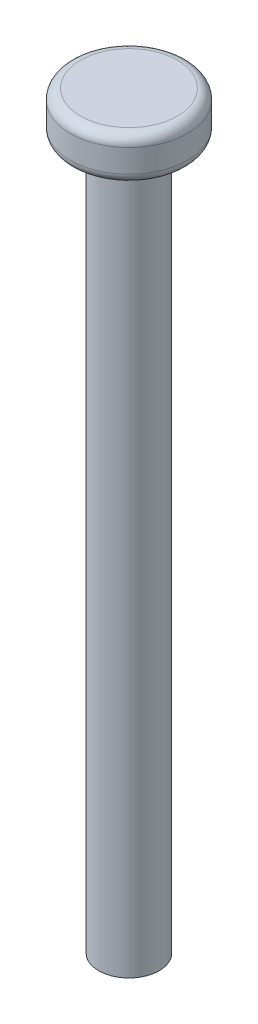
ISO-10303-21;
HEADER;
FILE_DESCRIPTION(('STEP AP214'),'2;1');
FILE_NAME('part.step','',(''),(''),'','','');
FILE_SCHEMA(('AUTOMOTIVE_DESIGN { 1 0 10303 214 1 1 1 1 }'));
ENDSEC;
DATA;
#1=APPLICATION_CONTEXT('core data for automotive mechanical design processes');
#2=APPLICATION_PROTOCOL_DEFINITION('international standard','automotive_design',2000,#1);
#3=PRODUCT_CONTEXT('',#1,'mechanical');
#4=PRODUCT('Part','Part','',(#3));
#5=PRODUCT_RELATED_PRODUCT_CATEGORY('part','',(#4));
#6=PRODUCT_DEFINITION_FORMATION('','',#4);
#7=PRODUCT_DEFINITION_CONTEXT('part definition',#1,'design');
#8=PRODUCT_DEFINITION('design','',#6,#7);
#9=PRODUCT_DEFINITION_SHAPE('','',#8);
#10=(LENGTH_UNIT() NAMED_UNIT(*) SI_UNIT(.MILLI.,.METRE.));
#11=(NAMED_UNIT(*) PLANE_ANGLE_UNIT() SI_UNIT($,.RADIAN.));
#12=(NAMED_UNIT(*) SI_UNIT($,.STERADIAN.) SOLID_ANGLE_UNIT());
#13=UNCERTAINTY_MEASURE_WITH_UNIT(LENGTH_MEASURE(1.E-05),#10,'distance_accuracy_value','');
#14=(GEOMETRIC_REPRESENTATION_CONTEXT(3) GLOBAL_UNCERTAINTY_ASSIGNED_CONTEXT((#13)) GLOBAL_UNIT_ASSIGNED_CONTEXT((#10,
#11,#12)) REPRESENTATION_CONTEXT('',''));
#15=CARTESIAN_POINT('',(0.,0.,0.));
#16=DIRECTION('',(0.,0.,1.));
#17=DIRECTION('',(1.,0.,0.));
#18=AXIS2_PLACEMENT_3D('',#15,#16,#17);
#19=CARTESIAN_POINT('',(0.,70.,0.));
#20=DIRECTION('',(0.,-1.,0.));
#21=DIRECTION('',(0.,0.,-1.));
#22=AXIS2_PLACEMENT_3D('',#19,#20,#21);
#23=CYLINDRICAL_SURFACE('',#22,3.);
#24=CARTESIAN_POINT('',(0.,70.,0.));
#25=DIRECTION('',(0.,1.,0.));
#26=DIRECTION('',(0.,0.,1.));
#27=AXIS2_PLACEMENT_3D('',#24,#25,#26);
#28=CIRCLE('',#27,3.);
#29=CARTESIAN_POINT('',(0.,70.,3.));
#30=VERTEX_POINT('',#29);
#31=EDGE_CURVE('E53',#30,#30,#28,.T.);
#32=ORIENTED_EDGE('',*,*,#31,.F.);
#33=EDGE_LOOP('',(#32));
#34=FACE_BOUND('',#33,.T.);
#35=CARTESIAN_POINT('',(0.,0.,0.));
#36=DIRECTION('',(0.,1.,0.));
#37=DIRECTION('',(0.,0.,1.));
#38=AXIS2_PLACEMENT_3D('',#35,#36,#37);
#39=CIRCLE('',#38,3.);
#40=CARTESIAN_POINT('',(0.,0.,3.));
#41=VERTEX_POINT('',#40);
#42=EDGE_CURVE('E54',#41,#41,#39,.T.);
#43=ORIENTED_EDGE('',*,*,#42,.T.);
#44=EDGE_LOOP('',(#43));
#45=FACE_BOUND('',#44,.T.);
#46=ADVANCED_FACE('F33',(#34,#45),#23,.T.);
#47=CARTESIAN_POINT('',(0.,0.,0.));
#48=DIRECTION('',(0.,1.,0.));
#49=DIRECTION('',(0.,0.,1.));
#50=AXIS2_PLACEMENT_3D('',#47,#48,#49);
#51=PLANE('',#50);
#52=ORIENTED_EDGE('',*,*,#42,.F.);
#53=EDGE_LOOP('',(#52));
#54=FACE_BOUND('',#53,.T.);
#55=ADVANCED_FACE('F64',(#54),#51,.F.);
#56=CARTESIAN_POINT('',(0.,74.3,0.));
#57=DIRECTION('',(0.,-1.,0.));
#58=DIRECTION('',(0.,0.,-1.));
#59=AXIS2_PLACEMENT_3D('',#56,#57,#58);
#60=CYLINDRICAL_SURFACE('',#59,5.8);
#61=CARTESIAN_POINT('',(0.,71.,0.));
#62=DIRECTION('',(0.,1.,0.));
#63=DIRECTION('',(0.,0.,1.));
#64=AXIS2_PLACEMENT_3D('',#61,#62,#63);
#65=CIRCLE('',#64,5.8);
#66=CARTESIAN_POINT('',(0.,71.,5.8));
#67=VERTEX_POINT('',#66);
#68=EDGE_CURVE('E44',#67,#67,#65,.T.);
#69=ORIENTED_EDGE('',*,*,#68,.T.);
#70=EDGE_LOOP('',(#69));
#71=FACE_BOUND('',#70,.T.);
#72=CARTESIAN_POINT('',(0.,73.3,0.));
#73=DIRECTION('',(0.,1.,0.));
#74=DIRECTION('',(0.,0.,1.));
#75=AXIS2_PLACEMENT_3D('',#72,#73,#74);
#76=CIRCLE('',#75,5.8);
#77=CARTESIAN_POINT('',(0.,73.3,5.8));
#78=VERTEX_POINT('',#77);
#79=EDGE_CURVE('E48',#78,#78,#76,.F.);
#80=ORIENTED_EDGE('',*,*,#79,.T.);
#81=EDGE_LOOP('',(#80));
#82=FACE_BOUND('',#81,.T.);
#83=ADVANCED_FACE('F69',(#71,#82),#60,.T.);
#84=CARTESIAN_POINT('',(0.,74.3,0.));
#85=DIRECTION('',(0.,1.,0.));
#86=DIRECTION('',(0.,0.,1.));
#87=AXIS2_PLACEMENT_3D('',#84,#85,#86);
#88=PLANE('',#87);
#89=CARTESIAN_POINT('',(0.,74.3,0.));
#90=DIRECTION('',(0.,1.,0.));
#91=DIRECTION('',(0.,0.,1.));
#92=AXIS2_PLACEMENT_3D('',#89,#90,#91);
#93=CIRCLE('',#92,4.8);
#94=CARTESIAN_POINT('',(0.,74.3,4.8));
#95=VERTEX_POINT('',#94);
#96=EDGE_CURVE('E10',#95,#95,#93,.T.);
#97=ORIENTED_EDGE('',*,*,#96,.T.);
#98=EDGE_LOOP('',(#97));
#99=FACE_BOUND('',#98,.T.);
#100=ADVANCED_FACE('F74',(#99),#88,.T.);
#101=CARTESIAN_POINT('',(0.,70.,0.));
#102=DIRECTION('',(0.,1.,0.));
#103=DIRECTION('',(0.,0.,1.));
#104=AXIS2_PLACEMENT_3D('',#101,#102,#103);
#105=PLANE('',#104);
#106=CARTESIAN_POINT('',(0.,70.,0.));
#107=DIRECTION('',(0.,1.,0.));
#108=DIRECTION('',(0.,0.,1.));
#109=AXIS2_PLACEMENT_3D('',#106,#107,#108);
#110=CIRCLE('',#109,4.8);
#111=CARTESIAN_POINT('',(0.,70.,4.8));
#112=VERTEX_POINT('',#111);
#113=EDGE_CURVE('E40',#112,#112,#110,.F.);
#114=ORIENTED_EDGE('',*,*,#113,.T.);
#115=EDGE_LOOP('',(#114));
#116=FACE_BOUND('',#115,.T.);
#117=ORIENTED_EDGE('',*,*,#31,.T.);
#118=EDGE_LOOP('',(#117));
#119=FACE_BOUND('',#118,.T.);
#120=ADVANCED_FACE('F60',(#116,#119),#105,.F.);
#121=CARTESIAN_POINT('',(0.,71.,0.));
#122=DIRECTION('',(0.,1.,0.));
#123=DIRECTION('',(0.,0.,1.));
#124=AXIS2_PLACEMENT_3D('',#121,#122,#123);
#125=TOROIDAL_SURFACE('',#124,4.8,1.);
#126=ORIENTED_EDGE('',*,*,#113,.F.);
#127=EDGE_LOOP('',(#126));
#128=FACE_BOUND('',#127,.T.);
#129=ORIENTED_EDGE('',*,*,#68,.F.);
#130=EDGE_LOOP('',(#129));
#131=FACE_BOUND('',#130,.T.);
#132=ADVANCED_FACE('F78',(#128,#131),#125,.T.);
#133=CARTESIAN_POINT('',(0.,73.3,0.));
#134=DIRECTION('',(0.,1.,0.));
#135=DIRECTION('',(0.,0.,1.));
#136=AXIS2_PLACEMENT_3D('',#133,#134,#135);
#137=TOROIDAL_SURFACE('',#136,4.8,1.);
#138=ORIENTED_EDGE('',*,*,#79,.F.);
#139=EDGE_LOOP('',(#138));
#140=FACE_BOUND('',#139,.T.);
#141=ORIENTED_EDGE('',*,*,#96,.F.);
#142=EDGE_LOOP('',(#141));
#143=FACE_BOUND('',#142,.T.);
#144=ADVANCED_FACE('F35',(#140,#143),#137,.T.);
#145=CLOSED_SHELL('',(#46,#55,#83,#100,#120,#132,#144));
#146=MANIFOLD_SOLID_BREP('B2',#145);
#147=ADVANCED_BREP_SHAPE_REPRESENTATION('',(#18,#146),#14);
#148=SHAPE_DEFINITION_REPRESENTATION(#9,#147);
ENDSEC;
END-ISO-10303-21;
